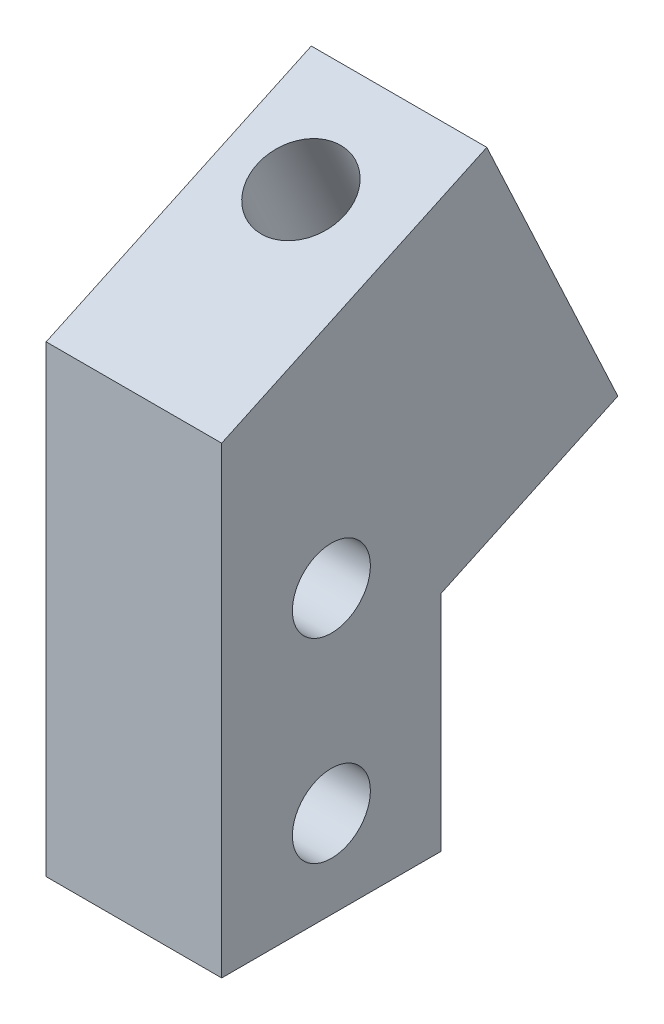
ISO-10303-21;
HEADER;
FILE_DESCRIPTION(('STEP AP214'),'2;1');
FILE_NAME('part.step','',(''),(''),'','','');
FILE_SCHEMA(('AUTOMOTIVE_DESIGN { 1 0 10303 214 1 1 1 1 }'));
ENDSEC;
DATA;
#1=APPLICATION_CONTEXT('core data for automotive mechanical design processes');
#2=APPLICATION_PROTOCOL_DEFINITION('international standard','automotive_design',2000,#1);
#3=PRODUCT_CONTEXT('',#1,'mechanical');
#4=PRODUCT('Part','Part','',(#3));
#5=PRODUCT_RELATED_PRODUCT_CATEGORY('part','',(#4));
#6=PRODUCT_DEFINITION_FORMATION('','',#4);
#7=PRODUCT_DEFINITION_CONTEXT('part definition',#1,'design');
#8=PRODUCT_DEFINITION('design','',#6,#7);
#9=PRODUCT_DEFINITION_SHAPE('','',#8);
#10=(LENGTH_UNIT() NAMED_UNIT(*) SI_UNIT(.MILLI.,.METRE.));
#11=(NAMED_UNIT(*) PLANE_ANGLE_UNIT() SI_UNIT($,.RADIAN.));
#12=(NAMED_UNIT(*) SI_UNIT($,.STERADIAN.) SOLID_ANGLE_UNIT());
#13=UNCERTAINTY_MEASURE_WITH_UNIT(LENGTH_MEASURE(1.E-05),#10,'distance_accuracy_value','');
#14=(GEOMETRIC_REPRESENTATION_CONTEXT(3) GLOBAL_UNCERTAINTY_ASSIGNED_CONTEXT((#13)) GLOBAL_UNIT_ASSIGNED_CONTEXT((#10,
#11,#12)) REPRESENTATION_CONTEXT('',''));
#15=CARTESIAN_POINT('',(0.,0.,0.));
#16=DIRECTION('',(0.,0.,1.));
#17=DIRECTION('',(1.,0.,0.));
#18=AXIS2_PLACEMENT_3D('',#15,#16,#17);
#19=CARTESIAN_POINT('',(18.,0.,0.));
#20=DIRECTION('',(-1.,0.,0.));
#21=DIRECTION('',(0.,0.,1.));
#22=AXIS2_PLACEMENT_3D('',#19,#20,#21);
#23=PLANE('',#22);
#24=DIRECTION('',(0.,-1.,0.));
#25=VECTOR('',#24,1.);
#26=CARTESIAN_POINT('',(18.,-23.75,11.25));
#27=LINE('',#26,#25);
#28=CARTESIAN_POINT('',(18.,23.75,11.25));
#29=VERTEX_POINT('',#28);
#30=CARTESIAN_POINT('',(18.,-23.75,11.25));
#31=VERTEX_POINT('',#30);
#32=EDGE_CURVE('E129',#29,#31,#27,.T.);
#33=ORIENTED_EDGE('',*,*,#32,.T.);
#34=DIRECTION('',(0.,0.,-1.));
#35=VECTOR('',#34,1.);
#36=CARTESIAN_POINT('',(18.,-23.75,11.25));
#37=LINE('',#36,#35);
#38=CARTESIAN_POINT('',(18.,-23.75,-11.25));
#39=VERTEX_POINT('',#38);
#40=EDGE_CURVE('E87',#31,#39,#37,.T.);
#41=ORIENTED_EDGE('',*,*,#40,.T.);
#42=DIRECTION('',(0.,1.,0.));
#43=VECTOR('',#42,1.);
#44=CARTESIAN_POINT('',(18.,-23.75,-11.25));
#45=LINE('',#44,#43);
#46=CARTESIAN_POINT('',(18.,-0.839389879939954,-11.25));
#47=VERTEX_POINT('',#46);
#48=EDGE_CURVE('E100',#39,#47,#45,.T.);
#49=ORIENTED_EDGE('',*,*,#48,.T.);
#50=DIRECTION('',(0.,0.422618261740701,-0.906307787036649));
#51=VECTOR('',#50,1.);
#52=CARTESIAN_POINT('',(18.,7.61297535487406,-29.376155740733));
#53=LINE('',#52,#51);
#54=CARTESIAN_POINT('',(18.,7.61297535487406,-29.376155740733));
#55=VERTEX_POINT('',#54);
#56=EDGE_CURVE('E94',#47,#55,#53,.T.);
#57=ORIENTED_EDGE('',*,*,#56,.T.);
#58=DIRECTION('',(0.,0.906307787036649,0.422618261740701));
#59=VECTOR('',#58,1.);
#60=CARTESIAN_POINT('',(18.,36.428547852221,-15.9392336110995));
#61=LINE('',#60,#59);
#62=CARTESIAN_POINT('',(18.,36.428547852221,-15.9392336110995));
#63=VERTEX_POINT('',#62);
#64=EDGE_CURVE('E98',#55,#63,#61,.T.);
#65=ORIENTED_EDGE('',*,*,#64,.T.);
#66=DIRECTION('',(0.,-0.422618261740701,0.906307787036649));
#67=VECTOR('',#66,1.);
#68=CARTESIAN_POINT('',(18.,23.75,11.25));
#69=LINE('',#68,#67);
#70=EDGE_CURVE('E50',#63,#29,#69,.T.);
#71=ORIENTED_EDGE('',*,*,#70,.T.);
#72=EDGE_LOOP('',(#33,#41,#49,#57,#65,#71));
#73=FACE_BOUND('',#72,.T.);
#74=CARTESIAN_POINT('',(18.,-14.75,0.));
#75=DIRECTION('',(1.,0.,0.));
#76=DIRECTION('',(0.,0.,-1.));
#77=AXIS2_PLACEMENT_3D('',#74,#75,#76);
#78=CIRCLE('',#77,4.);
#79=CARTESIAN_POINT('',(18.,-14.75,-4.));
#80=VERTEX_POINT('',#79);
#81=EDGE_CURVE('E122',#80,#80,#78,.T.);
#82=ORIENTED_EDGE('',*,*,#81,.F.);
#83=EDGE_LOOP('',(#82));
#84=FACE_BOUND('',#83,.T.);
#85=CARTESIAN_POINT('',(18.,5.25000000000001,0.));
#86=DIRECTION('',(1.,0.,0.));
#87=DIRECTION('',(0.,0.,-1.));
#88=AXIS2_PLACEMENT_3D('',#85,#86,#87);
#89=CIRCLE('',#88,4.);
#90=CARTESIAN_POINT('',(18.,5.25000000000001,-4.));
#91=VERTEX_POINT('',#90);
#92=EDGE_CURVE('E183',#91,#91,#89,.T.);
#93=ORIENTED_EDGE('',*,*,#92,.F.);
#94=EDGE_LOOP('',(#93));
#95=FACE_BOUND('',#94,.T.);
#96=ADVANCED_FACE('F33',(#73,#84,#95),#23,.F.);
#97=CARTESIAN_POINT('',(0.,0.,0.));
#98=DIRECTION('',(-1.,0.,0.));
#99=DIRECTION('',(0.,0.,1.));
#100=AXIS2_PLACEMENT_3D('',#97,#98,#99);
#101=PLANE('',#100);
#102=CARTESIAN_POINT('',(0.,-14.75,0.));
#103=DIRECTION('',(1.,0.,0.));
#104=DIRECTION('',(0.,0.,-1.));
#105=AXIS2_PLACEMENT_3D('',#102,#103,#104);
#106=CIRCLE('',#105,4.);
#107=CARTESIAN_POINT('',(0.,-14.75,-4.));
#108=VERTEX_POINT('',#107);
#109=EDGE_CURVE('E188',#108,#108,#106,.T.);
#110=ORIENTED_EDGE('',*,*,#109,.T.);
#111=EDGE_LOOP('',(#110));
#112=FACE_BOUND('',#111,.T.);
#113=DIRECTION('',(0.,-1.,0.));
#114=VECTOR('',#113,1.);
#115=CARTESIAN_POINT('',(0.,-23.75,11.25));
#116=LINE('',#115,#114);
#117=CARTESIAN_POINT('',(0.,23.75,11.25));
#118=VERTEX_POINT('',#117);
#119=CARTESIAN_POINT('',(0.,-23.75,11.25));
#120=VERTEX_POINT('',#119);
#121=EDGE_CURVE('E118',#118,#120,#116,.T.);
#122=ORIENTED_EDGE('',*,*,#121,.F.);
#123=DIRECTION('',(0.,-0.422618261740701,0.906307787036649));
#124=VECTOR('',#123,1.);
#125=CARTESIAN_POINT('',(0.,23.75,11.25));
#126=LINE('',#125,#124);
#127=CARTESIAN_POINT('',(0.,36.428547852221,-15.9392336110995));
#128=VERTEX_POINT('',#127);
#129=EDGE_CURVE('E79',#128,#118,#126,.T.);
#130=ORIENTED_EDGE('',*,*,#129,.F.);
#131=DIRECTION('',(0.,0.906307787036649,0.422618261740701));
#132=VECTOR('',#131,1.);
#133=CARTESIAN_POINT('',(0.,36.428547852221,-15.9392336110995));
#134=LINE('',#133,#132);
#135=CARTESIAN_POINT('',(0.,7.61297535487406,-29.376155740733));
#136=VERTEX_POINT('',#135);
#137=EDGE_CURVE('E73',#136,#128,#134,.T.);
#138=ORIENTED_EDGE('',*,*,#137,.F.);
#139=DIRECTION('',(0.,0.422618261740701,-0.906307787036649));
#140=VECTOR('',#139,1.);
#141=CARTESIAN_POINT('',(0.,7.61297535487406,-29.376155740733));
#142=LINE('',#141,#140);
#143=CARTESIAN_POINT('',(0.,-0.839389879939954,-11.25));
#144=VERTEX_POINT('',#143);
#145=EDGE_CURVE('E108',#144,#136,#142,.T.);
#146=ORIENTED_EDGE('',*,*,#145,.F.);
#147=DIRECTION('',(0.,1.,0.));
#148=VECTOR('',#147,1.);
#149=CARTESIAN_POINT('',(0.,-23.75,-11.25));
#150=LINE('',#149,#148);
#151=CARTESIAN_POINT('',(0.,-23.75,-11.25));
#152=VERTEX_POINT('',#151);
#153=EDGE_CURVE('E124',#152,#144,#150,.T.);
#154=ORIENTED_EDGE('',*,*,#153,.F.);
#155=DIRECTION('',(0.,0.,-1.));
#156=VECTOR('',#155,1.);
#157=CARTESIAN_POINT('',(0.,-23.75,11.25));
#158=LINE('',#157,#156);
#159=EDGE_CURVE('E121',#120,#152,#158,.T.);
#160=ORIENTED_EDGE('',*,*,#159,.F.);
#161=EDGE_LOOP('',(#122,#130,#138,#146,#154,#160));
#162=FACE_BOUND('',#161,.T.);
#163=CARTESIAN_POINT('',(0.,5.25000000000001,0.));
#164=DIRECTION('',(1.,0.,0.));
#165=DIRECTION('',(0.,0.,-1.));
#166=AXIS2_PLACEMENT_3D('',#163,#164,#165);
#167=CIRCLE('',#166,4.);
#168=CARTESIAN_POINT('',(0.,5.25000000000001,-4.));
#169=VERTEX_POINT('',#168);
#170=EDGE_CURVE('E180',#169,#169,#167,.T.);
#171=ORIENTED_EDGE('',*,*,#170,.T.);
#172=EDGE_LOOP('',(#171));
#173=FACE_BOUND('',#172,.T.);
#174=ADVANCED_FACE('F138',(#112,#162,#173),#101,.T.);
#175=CARTESIAN_POINT('',(18.,-23.75,11.25));
#176=DIRECTION('',(0.,0.,-1.));
#177=DIRECTION('',(-1.,0.,0.));
#178=AXIS2_PLACEMENT_3D('',#175,#176,#177);
#179=PLANE('',#178);
#180=ORIENTED_EDGE('',*,*,#121,.T.);
#181=DIRECTION('',(-1.,0.,0.));
#182=VECTOR('',#181,1.);
#183=CARTESIAN_POINT('',(18.,-23.75,11.25));
#184=LINE('',#183,#182);
#185=EDGE_CURVE('E11',#31,#120,#184,.T.);
#186=ORIENTED_EDGE('',*,*,#185,.F.);
#187=ORIENTED_EDGE('',*,*,#32,.F.);
#188=DIRECTION('',(-1.,0.,0.));
#189=VECTOR('',#188,1.);
#190=CARTESIAN_POINT('',(18.,23.75,11.25));
#191=LINE('',#190,#189);
#192=EDGE_CURVE('E114',#29,#118,#191,.T.);
#193=ORIENTED_EDGE('',*,*,#192,.T.);
#194=EDGE_LOOP('',(#180,#186,#187,#193));
#195=FACE_BOUND('',#194,.T.);
#196=ADVANCED_FACE('F35',(#195),#179,.F.);
#197=CARTESIAN_POINT('',(18.,-23.75,11.25));
#198=DIRECTION('',(0.,1.,0.));
#199=DIRECTION('',(0.,0.,1.));
#200=AXIS2_PLACEMENT_3D('',#197,#198,#199);
#201=PLANE('',#200);
#202=ORIENTED_EDGE('',*,*,#159,.T.);
#203=DIRECTION('',(-1.,0.,0.));
#204=VECTOR('',#203,1.);
#205=CARTESIAN_POINT('',(18.,-23.75,-11.25));
#206=LINE('',#205,#204);
#207=EDGE_CURVE('E42',#39,#152,#206,.T.);
#208=ORIENTED_EDGE('',*,*,#207,.F.);
#209=ORIENTED_EDGE('',*,*,#40,.F.);
#210=ORIENTED_EDGE('',*,*,#185,.T.);
#211=EDGE_LOOP('',(#202,#208,#209,#210));
#212=FACE_BOUND('',#211,.T.);
#213=ADVANCED_FACE('F207',(#212),#201,.F.);
#214=CARTESIAN_POINT('',(18.,-23.75,-11.25));
#215=DIRECTION('',(0.,0.,1.));
#216=DIRECTION('',(1.,0.,0.));
#217=AXIS2_PLACEMENT_3D('',#214,#215,#216);
#218=PLANE('',#217);
#219=ORIENTED_EDGE('',*,*,#153,.T.);
#220=DIRECTION('',(-1.,0.,0.));
#221=VECTOR('',#220,1.);
#222=CARTESIAN_POINT('',(18.,-0.839389879939954,-11.25));
#223=LINE('',#222,#221);
#224=EDGE_CURVE('E109',#47,#144,#223,.T.);
#225=ORIENTED_EDGE('',*,*,#224,.F.);
#226=ORIENTED_EDGE('',*,*,#48,.F.);
#227=ORIENTED_EDGE('',*,*,#207,.T.);
#228=EDGE_LOOP('',(#219,#225,#226,#227));
#229=FACE_BOUND('',#228,.T.);
#230=ADVANCED_FACE('F135',(#229),#218,.F.);
#231=CARTESIAN_POINT('',(18.,7.61297535487406,-29.376155740733));
#232=DIRECTION('',(0.,0.906307787036649,0.422618261740701));
#233=DIRECTION('',(0.,-0.422618261740701,0.906307787036649));
#234=AXIS2_PLACEMENT_3D('',#231,#232,#233);
#235=PLANE('',#234);
#236=CARTESIAN_POINT('',(8.,3.38679273746706,-20.3130778703665));
#237=DIRECTION('',(0.,0.906307787036649,0.422618261740701));
#238=DIRECTION('',(0.,-0.422618261740701,0.906307787036649));
#239=AXIS2_PLACEMENT_3D('',#236,#237,#238);
#240=CIRCLE('',#239,4.5);
#241=CARTESIAN_POINT('',(8.,1.4850105596339,-16.2346928287016));
#242=VERTEX_POINT('',#241);
#243=EDGE_CURVE('E178',#242,#242,#240,.T.);
#244=ORIENTED_EDGE('',*,*,#243,.T.);
#245=EDGE_LOOP('',(#244));
#246=FACE_BOUND('',#245,.T.);
#247=ORIENTED_EDGE('',*,*,#145,.T.);
#248=DIRECTION('',(-1.,0.,0.));
#249=VECTOR('',#248,1.);
#250=CARTESIAN_POINT('',(18.,7.61297535487406,-29.376155740733));
#251=LINE('',#250,#249);
#252=EDGE_CURVE('E105',#55,#136,#251,.T.);
#253=ORIENTED_EDGE('',*,*,#252,.F.);
#254=ORIENTED_EDGE('',*,*,#56,.F.);
#255=ORIENTED_EDGE('',*,*,#224,.T.);
#256=EDGE_LOOP('',(#247,#253,#254,#255));
#257=FACE_BOUND('',#256,.T.);
#258=ADVANCED_FACE('F106',(#246,#257),#235,.F.);
#259=CARTESIAN_POINT('',(18.,36.428547852221,-15.9392336110995));
#260=DIRECTION('',(0.,-0.422618261740701,0.906307787036649));
#261=DIRECTION('',(0.,-0.906307787036649,-0.422618261740701));
#262=AXIS2_PLACEMENT_3D('',#259,#260,#261);
#263=PLANE('',#262);
#264=ORIENTED_EDGE('',*,*,#137,.T.);
#265=DIRECTION('',(-1.,0.,0.));
#266=VECTOR('',#265,1.);
#267=CARTESIAN_POINT('',(18.,36.428547852221,-15.9392336110995));
#268=LINE('',#267,#266);
#269=EDGE_CURVE('E110',#63,#128,#268,.T.);
#270=ORIENTED_EDGE('',*,*,#269,.F.);
#271=ORIENTED_EDGE('',*,*,#64,.F.);
#272=ORIENTED_EDGE('',*,*,#252,.T.);
#273=EDGE_LOOP('',(#264,#270,#271,#272));
#274=FACE_BOUND('',#273,.T.);
#275=ADVANCED_FACE('F112',(#274),#263,.F.);
#276=CARTESIAN_POINT('',(18.,23.75,11.25));
#277=DIRECTION('',(0.,-0.906307787036649,-0.422618261740701));
#278=DIRECTION('',(0.,0.422618261740701,-0.906307787036649));
#279=AXIS2_PLACEMENT_3D('',#276,#277,#278);
#280=PLANE('',#279);
#281=CARTESIAN_POINT('',(8.,32.202365234814,-6.87615574073299));
#282=DIRECTION('',(0.,0.906307787036649,0.422618261740701));
#283=DIRECTION('',(0.,-0.422618261740701,0.906307787036649));
#284=AXIS2_PLACEMENT_3D('',#281,#282,#283);
#285=CIRCLE('',#284,4.5);
#286=CARTESIAN_POINT('',(8.,30.3005830569809,-2.79777069906806));
#287=VERTEX_POINT('',#286);
#288=EDGE_CURVE('E175',#287,#287,#285,.T.);
#289=ORIENTED_EDGE('',*,*,#288,.F.);
#290=EDGE_LOOP('',(#289));
#291=FACE_BOUND('',#290,.T.);
#292=ORIENTED_EDGE('',*,*,#129,.T.);
#293=ORIENTED_EDGE('',*,*,#192,.F.);
#294=ORIENTED_EDGE('',*,*,#70,.F.);
#295=ORIENTED_EDGE('',*,*,#269,.T.);
#296=EDGE_LOOP('',(#292,#293,#294,#295));
#297=FACE_BOUND('',#296,.T.);
#298=ADVANCED_FACE('F143',(#291,#297),#280,.F.);
#299=CARTESIAN_POINT('',(18.,-14.75,0.));
#300=DIRECTION('',(-1.,0.,0.));
#301=DIRECTION('',(0.,0.,1.));
#302=AXIS2_PLACEMENT_3D('',#299,#300,#301);
#303=CYLINDRICAL_SURFACE('',#302,4.);
#304=ORIENTED_EDGE('',*,*,#81,.T.);
#305=EDGE_LOOP('',(#304));
#306=FACE_BOUND('',#305,.T.);
#307=ORIENTED_EDGE('',*,*,#109,.F.);
#308=EDGE_LOOP('',(#307));
#309=FACE_BOUND('',#308,.T.);
#310=ADVANCED_FACE('F145',(#306,#309),#303,.F.);
#311=CARTESIAN_POINT('',(18.,5.25000000000001,0.));
#312=DIRECTION('',(-1.,0.,0.));
#313=DIRECTION('',(0.,0.,1.));
#314=AXIS2_PLACEMENT_3D('',#311,#312,#313);
#315=CYLINDRICAL_SURFACE('',#314,4.);
#316=ORIENTED_EDGE('',*,*,#92,.T.);
#317=EDGE_LOOP('',(#316));
#318=FACE_BOUND('',#317,.T.);
#319=ORIENTED_EDGE('',*,*,#170,.F.);
#320=EDGE_LOOP('',(#319));
#321=FACE_BOUND('',#320,.T.);
#322=ADVANCED_FACE('F152',(#318,#321),#315,.F.);
#323=CARTESIAN_POINT('',(8.,-22.3745609204786,-32.3257943655059));
#324=DIRECTION('',(0.,0.906307787036649,0.422618261740701));
#325=DIRECTION('',(0.,-0.422618261740701,0.906307787036649));
#326=AXIS2_PLACEMENT_3D('',#323,#324,#325);
#327=CYLINDRICAL_SURFACE('',#326,4.5);
#328=ORIENTED_EDGE('',*,*,#288,.T.);
#329=EDGE_LOOP('',(#328));
#330=FACE_BOUND('',#329,.T.);
#331=ORIENTED_EDGE('',*,*,#243,.F.);
#332=EDGE_LOOP('',(#331));
#333=FACE_BOUND('',#332,.T.);
#334=ADVANCED_FACE('F167',(#330,#333),#327,.F.);
#335=CLOSED_SHELL('',(#96,#174,#196,#213,#230,#258,#275,#298,#310,#322,#334));
#336=MANIFOLD_SOLID_BREP('B2',#335);
#337=ADVANCED_BREP_SHAPE_REPRESENTATION('',(#18,#336),#14);
#338=SHAPE_DEFINITION_REPRESENTATION(#9,#337);
ENDSEC;
END-ISO-10303-21;
